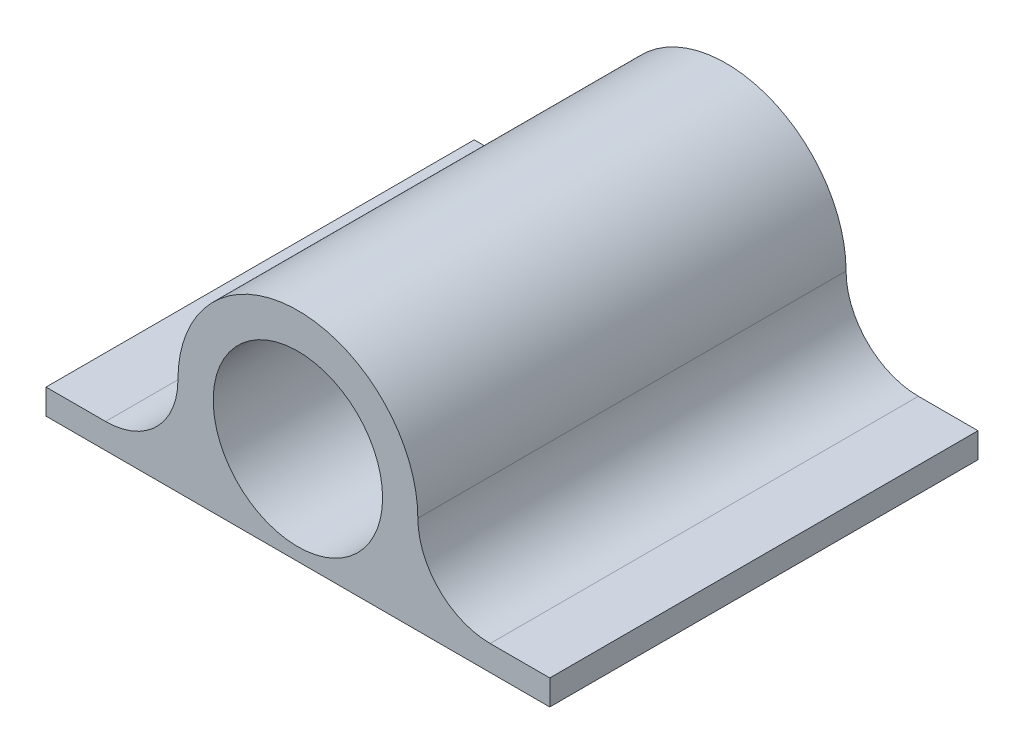
ISO-10303-21;
HEADER;
FILE_DESCRIPTION(('STEP AP214'),'2;1');
FILE_NAME('part.step','',(''),(''),'','','');
FILE_SCHEMA(('AUTOMOTIVE_DESIGN { 1 0 10303 214 1 1 1 1 }'));
ENDSEC;
DATA;
#1=APPLICATION_CONTEXT('core data for automotive mechanical design processes');
#2=APPLICATION_PROTOCOL_DEFINITION('international standard','automotive_design',2000,#1);
#3=PRODUCT_CONTEXT('',#1,'mechanical');
#4=PRODUCT('Part','Part','',(#3));
#5=PRODUCT_RELATED_PRODUCT_CATEGORY('part','',(#4));
#6=PRODUCT_DEFINITION_FORMATION('','',#4);
#7=PRODUCT_DEFINITION_CONTEXT('part definition',#1,'design');
#8=PRODUCT_DEFINITION('design','',#6,#7);
#9=PRODUCT_DEFINITION_SHAPE('','',#8);
#10=(LENGTH_UNIT() NAMED_UNIT(*) SI_UNIT(.MILLI.,.METRE.));
#11=(NAMED_UNIT(*) PLANE_ANGLE_UNIT() SI_UNIT($,.RADIAN.));
#12=(NAMED_UNIT(*) SI_UNIT($,.STERADIAN.) SOLID_ANGLE_UNIT());
#13=UNCERTAINTY_MEASURE_WITH_UNIT(LENGTH_MEASURE(1.E-05),#10,'distance_accuracy_value','');
#14=(GEOMETRIC_REPRESENTATION_CONTEXT(3) GLOBAL_UNCERTAINTY_ASSIGNED_CONTEXT((#13)) GLOBAL_UNIT_ASSIGNED_CONTEXT((#10,
#11,#12)) REPRESENTATION_CONTEXT('',''));
#15=CARTESIAN_POINT('',(0.,0.,0.));
#16=DIRECTION('',(0.,0.,1.));
#17=DIRECTION('',(1.,0.,0.));
#18=AXIS2_PLACEMENT_3D('',#15,#16,#17);
#19=CARTESIAN_POINT('',(0.,0.,20.32));
#20=DIRECTION('',(0.,0.,-1.));
#21=DIRECTION('',(-1.,0.,0.));
#22=AXIS2_PLACEMENT_3D('',#19,#20,#21);
#23=CYLINDRICAL_SURFACE('',#22,3.1115);
#24=CARTESIAN_POINT('',(0.,0.,0.));
#25=DIRECTION('',(0.,0.,1.));
#26=DIRECTION('',(1.,0.,0.));
#27=AXIS2_PLACEMENT_3D('',#24,#25,#26);
#28=CIRCLE('',#27,3.1115);
#29=CARTESIAN_POINT('',(3.1115,0.,0.));
#30=VERTEX_POINT('',#29);
#31=EDGE_CURVE('E140',#30,#30,#28,.T.);
#32=ORIENTED_EDGE('',*,*,#31,.F.);
#33=EDGE_LOOP('',(#32));
#34=FACE_BOUND('',#33,.T.);
#35=CARTESIAN_POINT('',(0.,0.,10.16));
#36=DIRECTION('',(0.,0.,1.));
#37=DIRECTION('',(1.,0.,0.));
#38=AXIS2_PLACEMENT_3D('',#35,#36,#37);
#39=CIRCLE('',#38,3.1115);
#40=CARTESIAN_POINT('',(3.1115,0.,10.16));
#41=VERTEX_POINT('',#40);
#42=EDGE_CURVE('E37',#41,#41,#39,.T.);
#43=ORIENTED_EDGE('',*,*,#42,.T.);
#44=EDGE_LOOP('',(#43));
#45=FACE_BOUND('',#44,.T.);
#46=ADVANCED_FACE('F33',(#34,#45),#23,.F.);
#47=CARTESIAN_POINT('',(-9.69453928769707,0.,20.32));
#48=DIRECTION('',(0.,0.,-1.));
#49=DIRECTION('',(-1.,0.,0.));
#50=AXIS2_PLACEMENT_3D('',#47,#48,#49);
#51=PLANE('',#50);
#52=CARTESIAN_POINT('',(0.,0.,20.32));
#53=DIRECTION('',(0.,0.,1.));
#54=DIRECTION('',(1.,0.,0.));
#55=AXIS2_PLACEMENT_3D('',#52,#53,#54);
#56=CIRCLE('',#55,4.27);
#57=CARTESIAN_POINT('',(4.27,0.,20.32));
#58=VERTEX_POINT('',#57);
#59=EDGE_CURVE('E234',#58,#58,#56,.T.);
#60=ORIENTED_EDGE('',*,*,#59,.F.);
#61=EDGE_LOOP('',(#60));
#62=FACE_BOUND('',#61,.T.);
#63=DIRECTION('',(0.,-1.,0.));
#64=VECTOR('',#63,1.);
#65=CARTESIAN_POINT('',(-12.7,-4.91653928769707,20.32));
#66=LINE('',#65,#64);
#67=CARTESIAN_POINT('',(-12.7,-3.64653928769707,20.32));
#68=VERTEX_POINT('',#67);
#69=CARTESIAN_POINT('',(-12.7,-4.91653928769707,20.32));
#70=VERTEX_POINT('',#69);
#71=EDGE_CURVE('E143',#68,#70,#66,.T.);
#72=ORIENTED_EDGE('',*,*,#71,.T.);
#73=DIRECTION('',(1.,0.,0.));
#74=VECTOR('',#73,1.);
#75=CARTESIAN_POINT('',(12.7,-4.91653928769706,20.32));
#76=LINE('',#75,#74);
#77=CARTESIAN_POINT('',(12.7,-4.91653928769706,20.32));
#78=VERTEX_POINT('',#77);
#79=EDGE_CURVE('E103',#70,#78,#76,.T.);
#80=ORIENTED_EDGE('',*,*,#79,.T.);
#81=DIRECTION('',(0.,1.,0.));
#82=VECTOR('',#81,1.);
#83=CARTESIAN_POINT('',(12.7,-4.91653928769706,20.32));
#84=LINE('',#83,#82);
#85=CARTESIAN_POINT('',(12.7,-3.64653928769706,20.32));
#86=VERTEX_POINT('',#85);
#87=EDGE_CURVE('E146',#78,#86,#84,.T.);
#88=ORIENTED_EDGE('',*,*,#87,.T.);
#89=DIRECTION('',(-1.,0.,0.));
#90=VECTOR('',#89,1.);
#91=CARTESIAN_POINT('',(12.7,-3.64653928769706,20.32));
#92=LINE('',#91,#90);
#93=CARTESIAN_POINT('',(9.69453928769706,-3.64653928769706,20.32));
#94=VERTEX_POINT('',#93);
#95=EDGE_CURVE('E148',#86,#94,#92,.T.);
#96=ORIENTED_EDGE('',*,*,#95,.T.);
#97=CARTESIAN_POINT('',(9.69453928769706,0.,20.32));
#98=DIRECTION('',(0.,0.,-1.));
#99=DIRECTION('',(1.,0.,0.));
#100=AXIS2_PLACEMENT_3D('',#97,#98,#99);
#101=CIRCLE('',#100,3.64653928769706);
#102=CARTESIAN_POINT('',(6.048,0.,20.32));
#103=VERTEX_POINT('',#102);
#104=EDGE_CURVE('E150',#94,#103,#101,.T.);
#105=ORIENTED_EDGE('',*,*,#104,.T.);
#106=CARTESIAN_POINT('',(0.,0.,20.32));
#107=DIRECTION('',(0.,0.,1.));
#108=DIRECTION('',(-1.,0.,0.));
#109=AXIS2_PLACEMENT_3D('',#106,#107,#108);
#110=CIRCLE('',#109,6.048);
#111=CARTESIAN_POINT('',(-6.048,0.,20.32));
#112=VERTEX_POINT('',#111);
#113=EDGE_CURVE('E152',#103,#112,#110,.T.);
#114=ORIENTED_EDGE('',*,*,#113,.T.);
#115=CARTESIAN_POINT('',(-9.69453928769707,0.,20.32));
#116=DIRECTION('',(0.,0.,-1.));
#117=DIRECTION('',(-1.,0.,0.));
#118=AXIS2_PLACEMENT_3D('',#115,#116,#117);
#119=CIRCLE('',#118,3.64653928769707);
#120=CARTESIAN_POINT('',(-9.69453928769706,-3.64653928769707,20.32));
#121=VERTEX_POINT('',#120);
#122=EDGE_CURVE('E54',#112,#121,#119,.T.);
#123=ORIENTED_EDGE('',*,*,#122,.T.);
#124=DIRECTION('',(-1.,0.,0.));
#125=VECTOR('',#124,1.);
#126=CARTESIAN_POINT('',(-9.69453928769706,-3.64653928769707,20.32));
#127=LINE('',#126,#125);
#128=EDGE_CURVE('E49',#121,#68,#127,.T.);
#129=ORIENTED_EDGE('',*,*,#128,.T.);
#130=EDGE_LOOP('',(#72,#80,#88,#96,#105,#114,#123,#129));
#131=FACE_BOUND('',#130,.T.);
#132=ADVANCED_FACE('F172',(#62,#131),#51,.F.);
#133=CARTESIAN_POINT('',(-12.7,-4.91653928769707,20.32));
#134=DIRECTION('',(1.,0.,0.));
#135=DIRECTION('',(0.,0.,-1.));
#136=AXIS2_PLACEMENT_3D('',#133,#134,#135);
#137=PLANE('',#136);
#138=DIRECTION('',(0.,0.,-1.));
#139=VECTOR('',#138,1.);
#140=CARTESIAN_POINT('',(-12.7,-3.64653928769707,20.32));
#141=LINE('',#140,#139);
#142=CARTESIAN_POINT('',(-12.7,-3.64653928769707,-1.27));
#143=VERTEX_POINT('',#142);
#144=EDGE_CURVE('E108',#68,#143,#141,.T.);
#145=ORIENTED_EDGE('',*,*,#144,.T.);
#146=DIRECTION('',(0.,1.,0.));
#147=VECTOR('',#146,1.);
#148=CARTESIAN_POINT('',(-12.7,-4.91653928769707,-1.27));
#149=LINE('',#148,#147);
#150=CARTESIAN_POINT('',(-12.7,-4.91653928769707,-1.27));
#151=VERTEX_POINT('',#150);
#152=EDGE_CURVE('E107',#151,#143,#149,.T.);
#153=ORIENTED_EDGE('',*,*,#152,.F.);
#154=DIRECTION('',(0.,0.,-1.));
#155=VECTOR('',#154,1.);
#156=CARTESIAN_POINT('',(-12.7,-4.91653928769707,20.32));
#157=LINE('',#156,#155);
#158=EDGE_CURVE('E11',#70,#151,#157,.T.);
#159=ORIENTED_EDGE('',*,*,#158,.F.);
#160=ORIENTED_EDGE('',*,*,#71,.F.);
#161=EDGE_LOOP('',(#145,#153,#159,#160));
#162=FACE_BOUND('',#161,.T.);
#163=ADVANCED_FACE('F35',(#162),#137,.F.);
#164=CARTESIAN_POINT('',(12.7,-4.91653928769706,20.32));
#165=DIRECTION('',(0.,1.,0.));
#166=DIRECTION('',(-1.,0.,0.));
#167=AXIS2_PLACEMENT_3D('',#164,#165,#166);
#168=PLANE('',#167);
#169=ORIENTED_EDGE('',*,*,#158,.T.);
#170=DIRECTION('',(-1.,0.,0.));
#171=VECTOR('',#170,1.);
#172=CARTESIAN_POINT('',(12.7,-4.91653928769706,-1.27));
#173=LINE('',#172,#171);
#174=CARTESIAN_POINT('',(12.7,-4.91653928769706,-1.27));
#175=VERTEX_POINT('',#174);
#176=EDGE_CURVE('E102',#175,#151,#173,.T.);
#177=ORIENTED_EDGE('',*,*,#176,.F.);
#178=DIRECTION('',(0.,0.,-1.));
#179=VECTOR('',#178,1.);
#180=CARTESIAN_POINT('',(12.7,-4.91653928769706,20.32));
#181=LINE('',#180,#179);
#182=EDGE_CURVE('E42',#78,#175,#181,.T.);
#183=ORIENTED_EDGE('',*,*,#182,.F.);
#184=ORIENTED_EDGE('',*,*,#79,.F.);
#185=EDGE_LOOP('',(#169,#177,#183,#184));
#186=FACE_BOUND('',#185,.T.);
#187=ADVANCED_FACE('F99',(#186),#168,.F.);
#188=CARTESIAN_POINT('',(12.7,-4.91653928769706,20.32));
#189=DIRECTION('',(-1.,0.,0.));
#190=DIRECTION('',(0.,0.,1.));
#191=AXIS2_PLACEMENT_3D('',#188,#189,#190);
#192=PLANE('',#191);
#193=ORIENTED_EDGE('',*,*,#182,.T.);
#194=DIRECTION('',(0.,-1.,0.));
#195=VECTOR('',#194,1.);
#196=CARTESIAN_POINT('',(12.7,-3.64653928769706,-1.27));
#197=LINE('',#196,#195);
#198=CARTESIAN_POINT('',(12.7,-3.64653928769706,-1.27));
#199=VERTEX_POINT('',#198);
#200=EDGE_CURVE('E119',#199,#175,#197,.T.);
#201=ORIENTED_EDGE('',*,*,#200,.F.);
#202=DIRECTION('',(0.,0.,-1.));
#203=VECTOR('',#202,1.);
#204=CARTESIAN_POINT('',(12.7,-3.64653928769706,20.32));
#205=LINE('',#204,#203);
#206=EDGE_CURVE('E165',#86,#199,#205,.T.);
#207=ORIENTED_EDGE('',*,*,#206,.F.);
#208=ORIENTED_EDGE('',*,*,#87,.F.);
#209=EDGE_LOOP('',(#193,#201,#207,#208));
#210=FACE_BOUND('',#209,.T.);
#211=ADVANCED_FACE('F169',(#210),#192,.F.);
#212=CARTESIAN_POINT('',(12.7,-3.64653928769706,20.32));
#213=DIRECTION('',(0.,-1.,0.));
#214=DIRECTION('',(1.,0.,0.));
#215=AXIS2_PLACEMENT_3D('',#212,#213,#214);
#216=PLANE('',#215);
#217=ORIENTED_EDGE('',*,*,#206,.T.);
#218=DIRECTION('',(1.,0.,0.));
#219=VECTOR('',#218,1.);
#220=CARTESIAN_POINT('',(9.69453928769706,-3.64653928769706,-1.27));
#221=LINE('',#220,#219);
#222=CARTESIAN_POINT('',(9.69453928769706,-3.64653928769706,-1.27));
#223=VERTEX_POINT('',#222);
#224=EDGE_CURVE('E137',#223,#199,#221,.T.);
#225=ORIENTED_EDGE('',*,*,#224,.F.);
#226=DIRECTION('',(0.,0.,-1.));
#227=VECTOR('',#226,1.);
#228=CARTESIAN_POINT('',(9.69453928769706,-3.64653928769706,20.32));
#229=LINE('',#228,#227);
#230=EDGE_CURVE('E163',#94,#223,#229,.T.);
#231=ORIENTED_EDGE('',*,*,#230,.F.);
#232=ORIENTED_EDGE('',*,*,#95,.F.);
#233=EDGE_LOOP('',(#217,#225,#231,#232));
#234=FACE_BOUND('',#233,.T.);
#235=ADVANCED_FACE('F178',(#234),#216,.F.);
#236=CARTESIAN_POINT('',(9.69453928769706,0.,20.32));
#237=DIRECTION('',(0.,0.,-1.));
#238=DIRECTION('',(-1.,0.,0.));
#239=AXIS2_PLACEMENT_3D('',#236,#237,#238);
#240=CYLINDRICAL_SURFACE('',#239,3.64653928769706);
#241=ORIENTED_EDGE('',*,*,#230,.T.);
#242=CARTESIAN_POINT('',(9.69453928769706,0.,-1.27));
#243=DIRECTION('',(0.,0.,1.));
#244=DIRECTION('',(-1.,0.,0.));
#245=AXIS2_PLACEMENT_3D('',#242,#243,#244);
#246=CIRCLE('',#245,3.64653928769706);
#247=CARTESIAN_POINT('',(6.048,0.,-1.27));
#248=VERTEX_POINT('',#247);
#249=EDGE_CURVE('E134',#248,#223,#246,.T.);
#250=ORIENTED_EDGE('',*,*,#249,.F.);
#251=DIRECTION('',(0.,0.,-1.));
#252=VECTOR('',#251,1.);
#253=CARTESIAN_POINT('',(6.048,0.,20.32));
#254=LINE('',#253,#252);
#255=EDGE_CURVE('E161',#103,#248,#254,.T.);
#256=ORIENTED_EDGE('',*,*,#255,.F.);
#257=ORIENTED_EDGE('',*,*,#104,.F.);
#258=EDGE_LOOP('',(#241,#250,#256,#257));
#259=FACE_BOUND('',#258,.T.);
#260=ADVANCED_FACE('F181',(#259),#240,.F.);
#261=CARTESIAN_POINT('',(0.,0.,20.32));
#262=DIRECTION('',(0.,0.,-1.));
#263=DIRECTION('',(-1.,0.,0.));
#264=AXIS2_PLACEMENT_3D('',#261,#262,#263);
#265=CYLINDRICAL_SURFACE('',#264,6.048);
#266=ORIENTED_EDGE('',*,*,#255,.T.);
#267=CARTESIAN_POINT('',(0.,0.,-1.27));
#268=DIRECTION('',(0.,0.,-1.));
#269=DIRECTION('',(-1.,0.,0.));
#270=AXIS2_PLACEMENT_3D('',#267,#268,#269);
#271=CIRCLE('',#270,6.048);
#272=CARTESIAN_POINT('',(-6.048,0.,-1.27));
#273=VERTEX_POINT('',#272);
#274=EDGE_CURVE('E131',#273,#248,#271,.T.);
#275=ORIENTED_EDGE('',*,*,#274,.F.);
#276=DIRECTION('',(0.,0.,-1.));
#277=VECTOR('',#276,1.);
#278=CARTESIAN_POINT('',(-6.048,0.,20.32));
#279=LINE('',#278,#277);
#280=EDGE_CURVE('E159',#112,#273,#279,.T.);
#281=ORIENTED_EDGE('',*,*,#280,.F.);
#282=ORIENTED_EDGE('',*,*,#113,.F.);
#283=EDGE_LOOP('',(#266,#275,#281,#282));
#284=FACE_BOUND('',#283,.T.);
#285=ADVANCED_FACE('F186',(#284),#265,.T.);
#286=CARTESIAN_POINT('',(-9.69453928769707,0.,20.32));
#287=DIRECTION('',(0.,0.,-1.));
#288=DIRECTION('',(-1.,0.,0.));
#289=AXIS2_PLACEMENT_3D('',#286,#287,#288);
#290=CYLINDRICAL_SURFACE('',#289,3.64653928769707);
#291=ORIENTED_EDGE('',*,*,#280,.T.);
#292=CARTESIAN_POINT('',(-9.69453928769707,0.,-1.27));
#293=DIRECTION('',(0.,0.,1.));
#294=DIRECTION('',(-1.,0.,0.));
#295=AXIS2_PLACEMENT_3D('',#292,#293,#294);
#296=CIRCLE('',#295,3.64653928769707);
#297=CARTESIAN_POINT('',(-9.69453928769706,-3.64653928769707,-1.27));
#298=VERTEX_POINT('',#297);
#299=EDGE_CURVE('E128',#298,#273,#296,.T.);
#300=ORIENTED_EDGE('',*,*,#299,.F.);
#301=DIRECTION('',(0.,0.,-1.));
#302=VECTOR('',#301,1.);
#303=CARTESIAN_POINT('',(-9.69453928769706,-3.64653928769707,20.32));
#304=LINE('',#303,#302);
#305=EDGE_CURVE('E157',#121,#298,#304,.T.);
#306=ORIENTED_EDGE('',*,*,#305,.F.);
#307=ORIENTED_EDGE('',*,*,#122,.F.);
#308=EDGE_LOOP('',(#291,#300,#306,#307));
#309=FACE_BOUND('',#308,.T.);
#310=ADVANCED_FACE('F189',(#309),#290,.F.);
#311=CARTESIAN_POINT('',(-9.69453928769706,-3.64653928769707,20.32));
#312=DIRECTION('',(0.,-1.,0.));
#313=DIRECTION('',(1.,0.,0.));
#314=AXIS2_PLACEMENT_3D('',#311,#312,#313);
#315=PLANE('',#314);
#316=ORIENTED_EDGE('',*,*,#305,.T.);
#317=DIRECTION('',(1.,0.,0.));
#318=VECTOR('',#317,1.);
#319=CARTESIAN_POINT('',(-12.7,-3.64653928769707,-1.27));
#320=LINE('',#319,#318);
#321=EDGE_CURVE('E112',#143,#298,#320,.T.);
#322=ORIENTED_EDGE('',*,*,#321,.F.);
#323=ORIENTED_EDGE('',*,*,#144,.F.);
#324=ORIENTED_EDGE('',*,*,#128,.F.);
#325=EDGE_LOOP('',(#316,#322,#323,#324));
#326=FACE_BOUND('',#325,.T.);
#327=ADVANCED_FACE('F191',(#326),#315,.F.);
#328=CARTESIAN_POINT('',(-9.69453928769707,0.,0.));
#329=DIRECTION('',(0.,0.,-1.));
#330=DIRECTION('',(-1.,0.,0.));
#331=AXIS2_PLACEMENT_3D('',#328,#329,#330);
#332=PLANE('',#331);
#333=CARTESIAN_POINT('',(0.,0.,0.));
#334=DIRECTION('',(0.,0.,-1.));
#335=DIRECTION('',(-1.,0.,0.));
#336=AXIS2_PLACEMENT_3D('',#333,#334,#335);
#337=CIRCLE('',#336,1.905);
#338=CARTESIAN_POINT('',(-1.905,0.,0.));
#339=VERTEX_POINT('',#338);
#340=EDGE_CURVE('E123',#339,#339,#337,.T.);
#341=ORIENTED_EDGE('',*,*,#340,.T.);
#342=EDGE_LOOP('',(#341));
#343=FACE_BOUND('',#342,.T.);
#344=ORIENTED_EDGE('',*,*,#31,.T.);
#345=EDGE_LOOP('',(#344));
#346=FACE_BOUND('',#345,.T.);
#347=ADVANCED_FACE('F193',(#343,#346),#332,.F.);
#348=CARTESIAN_POINT('',(-9.69453928769707,0.,-1.27));
#349=DIRECTION('',(0.,0.,-1.));
#350=DIRECTION('',(-1.,0.,0.));
#351=AXIS2_PLACEMENT_3D('',#348,#349,#350);
#352=PLANE('',#351);
#353=ORIENTED_EDGE('',*,*,#176,.T.);
#354=ORIENTED_EDGE('',*,*,#152,.T.);
#355=ORIENTED_EDGE('',*,*,#321,.T.);
#356=ORIENTED_EDGE('',*,*,#299,.T.);
#357=ORIENTED_EDGE('',*,*,#274,.T.);
#358=ORIENTED_EDGE('',*,*,#249,.T.);
#359=ORIENTED_EDGE('',*,*,#224,.T.);
#360=ORIENTED_EDGE('',*,*,#200,.T.);
#361=EDGE_LOOP('',(#353,#354,#355,#356,#357,#358,#359,#360));
#362=FACE_BOUND('',#361,.T.);
#363=CARTESIAN_POINT('',(0.,0.,-1.27));
#364=DIRECTION('',(0.,0.,-1.));
#365=DIRECTION('',(-1.,0.,0.));
#366=AXIS2_PLACEMENT_3D('',#363,#364,#365);
#367=CIRCLE('',#366,1.905);
#368=CARTESIAN_POINT('',(-1.905,0.,-1.27));
#369=VERTEX_POINT('',#368);
#370=EDGE_CURVE('E120',#369,#369,#367,.T.);
#371=ORIENTED_EDGE('',*,*,#370,.F.);
#372=EDGE_LOOP('',(#371));
#373=FACE_BOUND('',#372,.T.);
#374=ADVANCED_FACE('F115',(#362,#373),#352,.T.);
#375=CARTESIAN_POINT('',(0.,0.,-1.27));
#376=DIRECTION('',(0.,0.,1.));
#377=DIRECTION('',(1.,0.,0.));
#378=AXIS2_PLACEMENT_3D('',#375,#376,#377);
#379=CYLINDRICAL_SURFACE('',#378,1.905);
#380=ORIENTED_EDGE('',*,*,#370,.T.);
#381=EDGE_LOOP('',(#380));
#382=FACE_BOUND('',#381,.T.);
#383=ORIENTED_EDGE('',*,*,#340,.F.);
#384=EDGE_LOOP('',(#383));
#385=FACE_BOUND('',#384,.T.);
#386=ADVANCED_FACE('F215',(#382,#385),#379,.F.);
#387=CARTESIAN_POINT('',(0.,0.,10.16));
#388=DIRECTION('',(0.,0.,1.));
#389=DIRECTION('',(1.,0.,0.));
#390=AXIS2_PLACEMENT_3D('',#387,#388,#389);
#391=CYLINDRICAL_SURFACE('',#390,4.27);
#392=CARTESIAN_POINT('',(0.,0.,10.16));
#393=DIRECTION('',(0.,0.,1.));
#394=DIRECTION('',(1.,0.,0.));
#395=AXIS2_PLACEMENT_3D('',#392,#393,#394);
#396=CIRCLE('',#395,4.27);
#397=CARTESIAN_POINT('',(4.27,0.,10.16));
#398=VERTEX_POINT('',#397);
#399=EDGE_CURVE('E233',#398,#398,#396,.T.);
#400=ORIENTED_EDGE('',*,*,#399,.F.);
#401=EDGE_LOOP('',(#400));
#402=FACE_BOUND('',#401,.T.);
#403=ORIENTED_EDGE('',*,*,#59,.T.);
#404=EDGE_LOOP('',(#403));
#405=FACE_BOUND('',#404,.T.);
#406=ADVANCED_FACE('F218',(#402,#405),#391,.F.);
#407=CARTESIAN_POINT('',(0.,0.,10.16));
#408=DIRECTION('',(0.,0.,1.));
#409=DIRECTION('',(1.,0.,0.));
#410=AXIS2_PLACEMENT_3D('',#407,#408,#409);
#411=PLANE('',#410);
#412=ORIENTED_EDGE('',*,*,#42,.F.);
#413=EDGE_LOOP('',(#412));
#414=FACE_BOUND('',#413,.T.);
#415=ORIENTED_EDGE('',*,*,#399,.T.);
#416=EDGE_LOOP('',(#415));
#417=FACE_BOUND('',#416,.T.);
#418=ADVANCED_FACE('F222',(#414,#417),#411,.T.);
#419=CLOSED_SHELL('',(#46,#132,#163,#187,#211,#235,#260,#285,#310,#327,#347,#374,#386,#406,#418));
#420=MANIFOLD_SOLID_BREP('B2',#419);
#421=ADVANCED_BREP_SHAPE_REPRESENTATION('',(#18,#420),#14);
#422=SHAPE_DEFINITION_REPRESENTATION(#9,#421);
ENDSEC;
END-ISO-10303-21;
